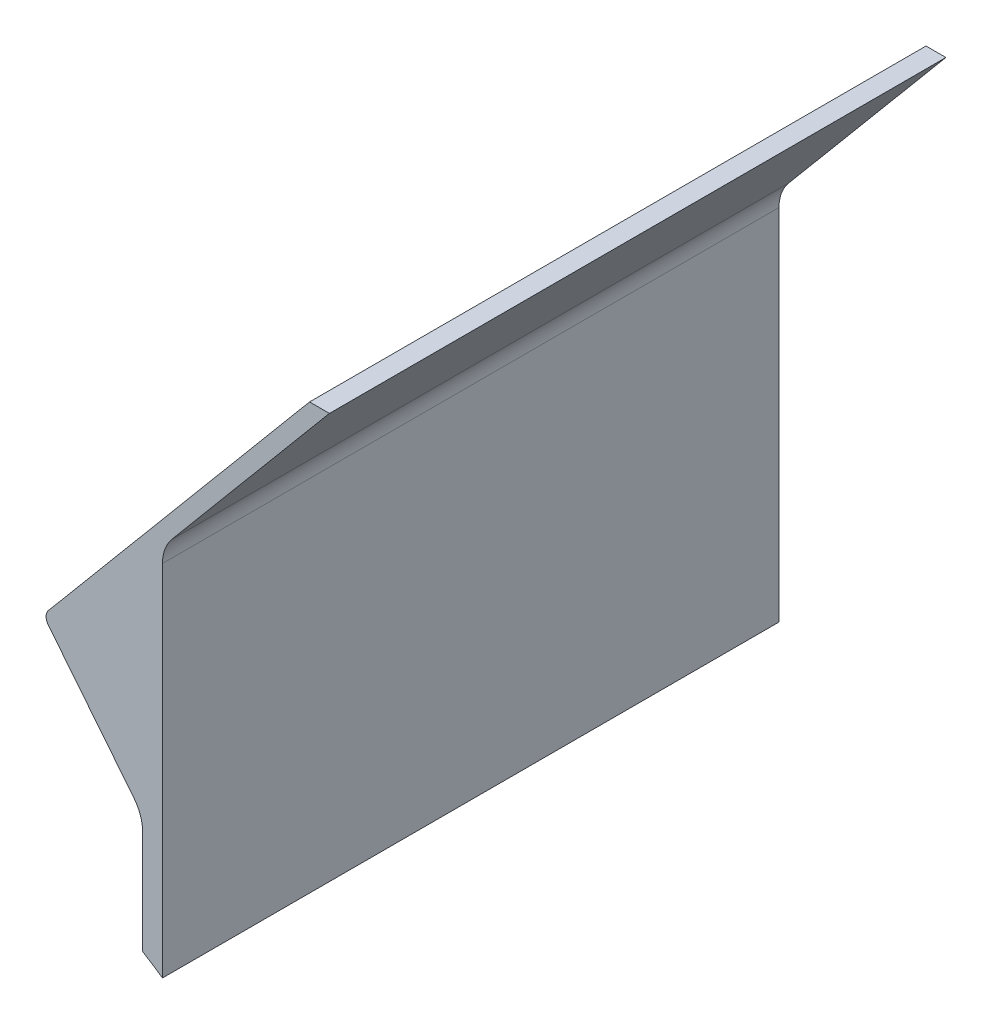
ISO-10303-21;
HEADER;
FILE_DESCRIPTION(('STEP AP214'),'2;1');
FILE_NAME('part.step','',(''),(''),'','','');
FILE_SCHEMA(('AUTOMOTIVE_DESIGN { 1 0 10303 214 1 1 1 1 }'));
ENDSEC;
DATA;
#1=APPLICATION_CONTEXT('core data for automotive mechanical design processes');
#2=APPLICATION_PROTOCOL_DEFINITION('international standard','automotive_design',2000,#1);
#3=PRODUCT_CONTEXT('',#1,'mechanical');
#4=PRODUCT('Part','Part','',(#3));
#5=PRODUCT_RELATED_PRODUCT_CATEGORY('part','',(#4));
#6=PRODUCT_DEFINITION_FORMATION('','',#4);
#7=PRODUCT_DEFINITION_CONTEXT('part definition',#1,'design');
#8=PRODUCT_DEFINITION('design','',#6,#7);
#9=PRODUCT_DEFINITION_SHAPE('','',#8);
#10=(LENGTH_UNIT() NAMED_UNIT(*) SI_UNIT(.MILLI.,.METRE.));
#11=(NAMED_UNIT(*) PLANE_ANGLE_UNIT() SI_UNIT($,.RADIAN.));
#12=(NAMED_UNIT(*) SI_UNIT($,.STERADIAN.) SOLID_ANGLE_UNIT());
#13=UNCERTAINTY_MEASURE_WITH_UNIT(LENGTH_MEASURE(1.E-05),#10,'distance_accuracy_value','');
#14=(GEOMETRIC_REPRESENTATION_CONTEXT(3) GLOBAL_UNCERTAINTY_ASSIGNED_CONTEXT((#13)) GLOBAL_UNIT_ASSIGNED_CONTEXT((#10,
#11,#12)) REPRESENTATION_CONTEXT('',''));
#15=CARTESIAN_POINT('',(0.,0.,0.));
#16=DIRECTION('',(0.,0.,1.));
#17=DIRECTION('',(1.,0.,0.));
#18=AXIS2_PLACEMENT_3D('',#15,#16,#17);
#19=CARTESIAN_POINT('',(-90.,-132.28756555323,155.));
#20=DIRECTION('',(0.,0.,-1.));
#21=DIRECTION('',(-1.,0.,0.));
#22=AXIS2_PLACEMENT_3D('',#19,#20,#21);
#23=CYLINDRICAL_SURFACE('',#22,160.);
#24=CARTESIAN_POINT('',(-90.,-132.28756555323,0.));
#25=DIRECTION('',(0.,0.,-1.));
#26=DIRECTION('',(1.,0.,0.));
#27=AXIS2_PLACEMENT_3D('',#24,#25,#26);
#28=CIRCLE('',#27,160.);
#29=CARTESIAN_POINT('',(-5.,3.26685156403007,0.));
#30=VERTEX_POINT('',#29);
#31=CARTESIAN_POINT('',(0.,0.,0.));
#32=VERTEX_POINT('',#31);
#33=EDGE_CURVE('E135',#30,#32,#28,.T.);
#34=ORIENTED_EDGE('',*,*,#33,.T.);
#35=DIRECTION('',(0.,0.,-1.));
#36=VECTOR('',#35,1.);
#37=CARTESIAN_POINT('',(0.,0.,155.));
#38=LINE('',#37,#36);
#39=CARTESIAN_POINT('',(0.,0.,155.));
#40=VERTEX_POINT('',#39);
#41=EDGE_CURVE('E116',#40,#32,#38,.T.);
#42=ORIENTED_EDGE('',*,*,#41,.F.);
#43=CARTESIAN_POINT('',(-90.,-132.28756555323,155.));
#44=DIRECTION('',(0.,0.,-1.));
#45=DIRECTION('',(1.,0.,0.));
#46=AXIS2_PLACEMENT_3D('',#43,#44,#45);
#47=CIRCLE('',#46,160.);
#48=CARTESIAN_POINT('',(-5.,3.26685156403007,155.));
#49=VERTEX_POINT('',#48);
#50=EDGE_CURVE('E123',#49,#40,#47,.T.);
#51=ORIENTED_EDGE('',*,*,#50,.F.);
#52=DIRECTION('',(0.,0.,-1.));
#53=VECTOR('',#52,1.);
#54=CARTESIAN_POINT('',(-5.,3.26685156403007,155.));
#55=LINE('',#54,#53);
#56=EDGE_CURVE('E183',#49,#30,#55,.T.);
#57=ORIENTED_EDGE('',*,*,#56,.T.);
#58=EDGE_LOOP('',(#34,#42,#51,#57));
#59=FACE_BOUND('',#58,.T.);
#60=ADVANCED_FACE('F34',(#59),#23,.F.);
#61=CARTESIAN_POINT('',(0.,0.,155.));
#62=DIRECTION('',(-1.,0.,0.));
#63=DIRECTION('',(0.,0.,1.));
#64=AXIS2_PLACEMENT_3D('',#61,#62,#63);
#65=PLANE('',#64);
#66=DIRECTION('',(0.,1.,0.));
#67=VECTOR('',#66,1.);
#68=CARTESIAN_POINT('',(0.,0.,0.));
#69=LINE('',#68,#67);
#70=CARTESIAN_POINT('',(0.,90.260297657338,0.));
#71=VERTEX_POINT('',#70);
#72=EDGE_CURVE('E193',#32,#71,#69,.T.);
#73=ORIENTED_EDGE('',*,*,#72,.T.);
#74=DIRECTION('',(0.,0.,-1.));
#75=VECTOR('',#74,1.);
#76=CARTESIAN_POINT('',(0.,90.260297657338,155.));
#77=LINE('',#76,#75);
#78=CARTESIAN_POINT('',(0.,90.260297657338,155.));
#79=VERTEX_POINT('',#78);
#80=EDGE_CURVE('E119',#71,#79,#77,.F.);
#81=ORIENTED_EDGE('',*,*,#80,.T.);
#82=DIRECTION('',(0.,1.,0.));
#83=VECTOR('',#82,1.);
#84=CARTESIAN_POINT('',(0.,0.,155.));
#85=LINE('',#84,#83);
#86=EDGE_CURVE('E111',#40,#79,#85,.T.);
#87=ORIENTED_EDGE('',*,*,#86,.F.);
#88=ORIENTED_EDGE('',*,*,#41,.T.);
#89=EDGE_LOOP('',(#73,#81,#87,#88));
#90=FACE_BOUND('',#89,.T.);
#91=ADVANCED_FACE('F114',(#90),#65,.F.);
#92=CARTESIAN_POINT('',(0.,93.9,155.));
#93=DIRECTION('',(-0.766044443118977,0.64278760968654,0.));
#94=DIRECTION('',(-0.64278760968654,-0.766044443118977,0.));
#95=AXIS2_PLACEMENT_3D('',#92,#93,#94);
#96=PLANE('',#95);
#97=DIRECTION('',(0.64278760968654,0.766044443118977,0.));
#98=VECTOR('',#97,1.);
#99=CARTESIAN_POINT('',(0.,93.9,155.));
#100=LINE('',#99,#98);
#101=CARTESIAN_POINT('',(2.33955556881023,96.6881737542034,155.));
#102=VERTEX_POINT('',#101);
#103=CARTESIAN_POINT('',(41.9740309125311,143.922702135669,155.));
#104=VERTEX_POINT('',#103);
#105=EDGE_CURVE('E122',#102,#104,#100,.T.);
#106=ORIENTED_EDGE('',*,*,#105,.F.);
#107=DIRECTION('',(0.,0.,-1.));
#108=VECTOR('',#107,1.);
#109=CARTESIAN_POINT('',(2.33955556881023,96.6881737542034,0.));
#110=LINE('',#109,#108);
#111=CARTESIAN_POINT('',(2.33955556881023,96.6881737542034,0.));
#112=VERTEX_POINT('',#111);
#113=EDGE_CURVE('E149',#102,#112,#110,.T.);
#114=ORIENTED_EDGE('',*,*,#113,.T.);
#115=DIRECTION('',(0.64278760968654,0.766044443118977,0.));
#116=VECTOR('',#115,1.);
#117=CARTESIAN_POINT('',(0.,93.9,0.));
#118=LINE('',#117,#116);
#119=CARTESIAN_POINT('',(41.9740309125311,143.922702135669,0.));
#120=VERTEX_POINT('',#119);
#121=EDGE_CURVE('E192',#112,#120,#118,.T.);
#122=ORIENTED_EDGE('',*,*,#121,.T.);
#123=DIRECTION('',(0.,0.,-1.));
#124=VECTOR('',#123,1.);
#125=CARTESIAN_POINT('',(41.9740309125311,143.922702135669,155.));
#126=LINE('',#125,#124);
#127=EDGE_CURVE('E137',#104,#120,#126,.T.);
#128=ORIENTED_EDGE('',*,*,#127,.F.);
#129=EDGE_LOOP('',(#106,#114,#122,#128));
#130=FACE_BOUND('',#129,.T.);
#131=ADVANCED_FACE('F207',(#130),#96,.F.);
#132=CARTESIAN_POINT('',(41.9740309125311,143.922702135669,155.));
#133=DIRECTION('',(0.,-1.,0.));
#134=DIRECTION('',(1.,0.,0.));
#135=AXIS2_PLACEMENT_3D('',#132,#133,#134);
#136=PLANE('',#135);
#137=DIRECTION('',(-1.,0.,0.));
#138=VECTOR('',#137,1.);
#139=CARTESIAN_POINT('',(41.9740309125311,143.922702135669,0.));
#140=LINE('',#139,#138);
#141=CARTESIAN_POINT('',(36.9740309125311,143.922702135669,0.));
#142=VERTEX_POINT('',#141);
#143=EDGE_CURVE('E179',#120,#142,#140,.T.);
#144=ORIENTED_EDGE('',*,*,#143,.T.);
#145=DIRECTION('',(0.,0.,-1.));
#146=VECTOR('',#145,1.);
#147=CARTESIAN_POINT('',(36.9740309125311,143.922702135669,155.));
#148=LINE('',#147,#146);
#149=CARTESIAN_POINT('',(36.9740309125311,143.922702135669,155.));
#150=VERTEX_POINT('',#149);
#151=EDGE_CURVE('E143',#150,#142,#148,.T.);
#152=ORIENTED_EDGE('',*,*,#151,.F.);
#153=DIRECTION('',(-1.,0.,0.));
#154=VECTOR('',#153,1.);
#155=CARTESIAN_POINT('',(41.9740309125311,143.922702135669,155.));
#156=LINE('',#155,#154);
#157=EDGE_CURVE('E201',#104,#150,#156,.T.);
#158=ORIENTED_EDGE('',*,*,#157,.F.);
#159=ORIENTED_EDGE('',*,*,#127,.T.);
#160=EDGE_LOOP('',(#144,#152,#158,#159));
#161=FACE_BOUND('',#160,.T.);
#162=ADVANCED_FACE('F208',(#161),#136,.F.);
#163=CARTESIAN_POINT('',(36.9740309125311,143.922702135669,155.));
#164=DIRECTION('',(0.766044443118977,-0.64278760968654,0.));
#165=DIRECTION('',(0.64278760968654,0.766044443118977,0.));
#166=AXIS2_PLACEMENT_3D('',#163,#164,#165);
#167=PLANE('',#166);
#168=DIRECTION('',(-0.64278760968654,-0.766044443118977,0.));
#169=VECTOR('',#168,1.);
#170=CARTESIAN_POINT('',(36.9740309125311,143.922702135669,0.));
#171=LINE('',#170,#169);
#172=CARTESIAN_POINT('',(-28.6827852863566,65.6759555523472,0.));
#173=VERTEX_POINT('',#172);
#174=EDGE_CURVE('E176',#142,#173,#171,.T.);
#175=ORIENTED_EDGE('',*,*,#174,.T.);
#176=DIRECTION('',(0.,0.,-1.));
#177=VECTOR('',#176,1.);
#178=CARTESIAN_POINT('',(-28.6827852863566,65.6759555523472,155.));
#179=LINE('',#178,#177);
#180=CARTESIAN_POINT('',(-28.6827852863566,65.6759555523472,155.));
#181=VERTEX_POINT('',#180);
#182=EDGE_CURVE('E42',#173,#181,#179,.F.);
#183=ORIENTED_EDGE('',*,*,#182,.T.);
#184=DIRECTION('',(-0.64278760968654,-0.766044443118977,0.));
#185=VECTOR('',#184,1.);
#186=CARTESIAN_POINT('',(36.9740309125311,143.922702135669,155.));
#187=LINE('',#186,#185);
#188=EDGE_CURVE('E187',#150,#181,#187,.T.);
#189=ORIENTED_EDGE('',*,*,#188,.F.);
#190=ORIENTED_EDGE('',*,*,#151,.T.);
#191=EDGE_LOOP('',(#175,#183,#189,#190));
#192=FACE_BOUND('',#191,.T.);
#193=ADVANCED_FACE('F186',(#192),#167,.F.);
#194=CARTESIAN_POINT('',(-30.,64.1061601851448,155.));
#195=DIRECTION('',(0.7806247497998,0.625,0.));
#196=DIRECTION('',(-0.625,0.7806247497998,0.));
#197=AXIS2_PLACEMENT_3D('',#194,#195,#196);
#198=PLANE('',#197);
#199=DIRECTION('',(0.625,-0.7806247497998,0.));
#200=VECTOR('',#199,1.);
#201=CARTESIAN_POINT('',(-30.,64.1061601851448,155.));
#202=LINE('',#201,#200);
#203=CARTESIAN_POINT('',(-28.7192360530587,62.5064865281309,155.));
#204=VERTEX_POINT('',#203);
#205=CARTESIAN_POINT('',(-7.19375250200201,35.6211661899496,155.));
#206=VERTEX_POINT('',#205);
#207=EDGE_CURVE('E170',#204,#206,#202,.T.);
#208=ORIENTED_EDGE('',*,*,#207,.F.);
#209=DIRECTION('',(0.,0.,-1.));
#210=VECTOR('',#209,1.);
#211=CARTESIAN_POINT('',(-28.7192360530587,62.5064865281309,155.));
#212=LINE('',#211,#210);
#213=CARTESIAN_POINT('',(-28.7192360530587,62.5064865281309,0.));
#214=VERTEX_POINT('',#213);
#215=EDGE_CURVE('E162',#204,#214,#212,.T.);
#216=ORIENTED_EDGE('',*,*,#215,.T.);
#217=DIRECTION('',(0.625,-0.7806247497998,0.));
#218=VECTOR('',#217,1.);
#219=CARTESIAN_POINT('',(-30.,64.1061601851448,0.));
#220=LINE('',#219,#218);
#221=CARTESIAN_POINT('',(-7.19375250200201,35.6211661899496,0.));
#222=VERTEX_POINT('',#221);
#223=EDGE_CURVE('E169',#214,#222,#220,.T.);
#224=ORIENTED_EDGE('',*,*,#223,.T.);
#225=DIRECTION('',(0.,0.,-1.));
#226=VECTOR('',#225,1.);
#227=CARTESIAN_POINT('',(-7.19375250200201,35.6211661899496,155.));
#228=LINE('',#227,#226);
#229=EDGE_CURVE('E140',#222,#206,#228,.F.);
#230=ORIENTED_EDGE('',*,*,#229,.T.);
#231=EDGE_LOOP('',(#208,#216,#224,#230));
#232=FACE_BOUND('',#231,.T.);
#233=ADVANCED_FACE('F168',(#232),#198,.F.);
#234=CARTESIAN_POINT('',(-5.,32.8811701931528,155.));
#235=DIRECTION('',(1.,0.,0.));
#236=DIRECTION('',(0.,0.,-1.));
#237=AXIS2_PLACEMENT_3D('',#234,#235,#236);
#238=PLANE('',#237);
#239=DIRECTION('',(0.,-1.,0.));
#240=VECTOR('',#239,1.);
#241=CARTESIAN_POINT('',(-5.,32.8811701931528,155.));
#242=LINE('',#241,#240);
#243=CARTESIAN_POINT('',(-5.,29.3711661899496,155.));
#244=VERTEX_POINT('',#243);
#245=EDGE_CURVE('E128',#244,#49,#242,.T.);
#246=ORIENTED_EDGE('',*,*,#245,.F.);
#247=DIRECTION('',(0.,0.,-1.));
#248=VECTOR('',#247,1.);
#249=CARTESIAN_POINT('',(-5.,29.3711661899496,0.));
#250=LINE('',#249,#248);
#251=CARTESIAN_POINT('',(-5.,29.3711661899496,0.));
#252=VERTEX_POINT('',#251);
#253=EDGE_CURVE('E136',#244,#252,#250,.T.);
#254=ORIENTED_EDGE('',*,*,#253,.T.);
#255=DIRECTION('',(0.,-1.,0.));
#256=VECTOR('',#255,1.);
#257=CARTESIAN_POINT('',(-5.,32.8811701931528,0.));
#258=LINE('',#257,#256);
#259=EDGE_CURVE('E132',#252,#30,#258,.T.);
#260=ORIENTED_EDGE('',*,*,#259,.T.);
#261=ORIENTED_EDGE('',*,*,#56,.F.);
#262=EDGE_LOOP('',(#246,#254,#260,#261));
#263=FACE_BOUND('',#262,.T.);
#264=ADVANCED_FACE('F234',(#263),#238,.F.);
#265=CARTESIAN_POINT('',(-90.,-132.28756555323,155.));
#266=DIRECTION('',(0.,0.,1.));
#267=DIRECTION('',(1.,0.,0.));
#268=AXIS2_PLACEMENT_3D('',#265,#266,#267);
#269=PLANE('',#268);
#270=ORIENTED_EDGE('',*,*,#188,.T.);
#271=CARTESIAN_POINT('',(-26.7676741785592,64.0689865281309,155.));
#272=DIRECTION('',(0.,0.,1.));
#273=DIRECTION('',(1.,0.,0.));
#274=AXIS2_PLACEMENT_3D('',#271,#272,#273);
#275=CIRCLE('',#274,2.5);
#276=EDGE_CURVE('E11',#181,#204,#275,.T.);
#277=ORIENTED_EDGE('',*,*,#276,.T.);
#278=ORIENTED_EDGE('',*,*,#207,.T.);
#279=CARTESIAN_POINT('',(-15.,29.3711661899496,155.));
#280=DIRECTION('',(0.,0.,1.));
#281=DIRECTION('',(1.,0.,0.));
#282=AXIS2_PLACEMENT_3D('',#279,#280,#281);
#283=CIRCLE('',#282,10.);
#284=EDGE_CURVE('E156',#206,#244,#283,.F.);
#285=ORIENTED_EDGE('',*,*,#284,.T.);
#286=ORIENTED_EDGE('',*,*,#245,.T.);
#287=ORIENTED_EDGE('',*,*,#50,.T.);
#288=ORIENTED_EDGE('',*,*,#86,.T.);
#289=CARTESIAN_POINT('',(10.,90.260297657338,155.));
#290=DIRECTION('',(0.,0.,1.));
#291=DIRECTION('',(1.,0.,0.));
#292=AXIS2_PLACEMENT_3D('',#289,#290,#291);
#293=CIRCLE('',#292,10.);
#294=EDGE_CURVE('E160',#79,#102,#293,.F.);
#295=ORIENTED_EDGE('',*,*,#294,.T.);
#296=ORIENTED_EDGE('',*,*,#105,.T.);
#297=ORIENTED_EDGE('',*,*,#157,.T.);
#298=EDGE_LOOP('',(#270,#277,#278,#285,#286,#287,#288,#295,#296,#297));
#299=FACE_BOUND('',#298,.T.);
#300=ADVANCED_FACE('F126',(#299),#269,.T.);
#301=CARTESIAN_POINT('',(-90.,-132.28756555323,0.));
#302=DIRECTION('',(0.,0.,1.));
#303=DIRECTION('',(1.,0.,0.));
#304=AXIS2_PLACEMENT_3D('',#301,#302,#303);
#305=PLANE('',#304);
#306=ORIENTED_EDGE('',*,*,#223,.F.);
#307=CARTESIAN_POINT('',(-26.7676741785592,64.0689865281309,0.));
#308=DIRECTION('',(0.,0.,1.));
#309=DIRECTION('',(1.,0.,0.));
#310=AXIS2_PLACEMENT_3D('',#307,#308,#309);
#311=CIRCLE('',#310,2.5);
#312=EDGE_CURVE('E56',#214,#173,#311,.F.);
#313=ORIENTED_EDGE('',*,*,#312,.T.);
#314=ORIENTED_EDGE('',*,*,#174,.F.);
#315=ORIENTED_EDGE('',*,*,#143,.F.);
#316=ORIENTED_EDGE('',*,*,#121,.F.);
#317=CARTESIAN_POINT('',(10.,90.260297657338,0.));
#318=DIRECTION('',(0.,0.,1.));
#319=DIRECTION('',(1.,0.,0.));
#320=AXIS2_PLACEMENT_3D('',#317,#318,#319);
#321=CIRCLE('',#320,10.);
#322=EDGE_CURVE('E158',#112,#71,#321,.T.);
#323=ORIENTED_EDGE('',*,*,#322,.T.);
#324=ORIENTED_EDGE('',*,*,#72,.F.);
#325=ORIENTED_EDGE('',*,*,#33,.F.);
#326=ORIENTED_EDGE('',*,*,#259,.F.);
#327=CARTESIAN_POINT('',(-15.,29.3711661899496,0.));
#328=DIRECTION('',(0.,0.,1.));
#329=DIRECTION('',(1.,0.,0.));
#330=AXIS2_PLACEMENT_3D('',#327,#328,#329);
#331=CIRCLE('',#330,10.);
#332=EDGE_CURVE('E153',#252,#222,#331,.T.);
#333=ORIENTED_EDGE('',*,*,#332,.T.);
#334=EDGE_LOOP('',(#306,#313,#314,#315,#316,#323,#324,#325,#326,#333));
#335=FACE_BOUND('',#334,.T.);
#336=ADVANCED_FACE('F173',(#335),#305,.F.);
#337=CARTESIAN_POINT('',(-15.,29.3711661899496,155.));
#338=DIRECTION('',(0.,0.,1.));
#339=DIRECTION('',(1.,0.,0.));
#340=AXIS2_PLACEMENT_3D('',#337,#338,#339);
#341=CYLINDRICAL_SURFACE('',#340,10.);
#342=ORIENTED_EDGE('',*,*,#284,.F.);
#343=ORIENTED_EDGE('',*,*,#229,.F.);
#344=ORIENTED_EDGE('',*,*,#332,.F.);
#345=ORIENTED_EDGE('',*,*,#253,.F.);
#346=EDGE_LOOP('',(#342,#343,#344,#345));
#347=FACE_BOUND('',#346,.T.);
#348=ADVANCED_FACE('F224',(#347),#341,.F.);
#349=CARTESIAN_POINT('',(10.,90.260297657338,155.));
#350=DIRECTION('',(0.,0.,1.));
#351=DIRECTION('',(1.,0.,0.));
#352=AXIS2_PLACEMENT_3D('',#349,#350,#351);
#353=CYLINDRICAL_SURFACE('',#352,10.);
#354=ORIENTED_EDGE('',*,*,#294,.F.);
#355=ORIENTED_EDGE('',*,*,#80,.F.);
#356=ORIENTED_EDGE('',*,*,#322,.F.);
#357=ORIENTED_EDGE('',*,*,#113,.F.);
#358=EDGE_LOOP('',(#354,#355,#356,#357));
#359=FACE_BOUND('',#358,.T.);
#360=ADVANCED_FACE('F226',(#359),#353,.F.);
#361=CARTESIAN_POINT('',(-26.7676741785592,64.0689865281309,155.));
#362=DIRECTION('',(0.,0.,-1.));
#363=DIRECTION('',(-1.,0.,0.));
#364=AXIS2_PLACEMENT_3D('',#361,#362,#363);
#365=CYLINDRICAL_SURFACE('',#364,2.5);
#366=ORIENTED_EDGE('',*,*,#276,.F.);
#367=ORIENTED_EDGE('',*,*,#182,.F.);
#368=ORIENTED_EDGE('',*,*,#312,.F.);
#369=ORIENTED_EDGE('',*,*,#215,.F.);
#370=EDGE_LOOP('',(#366,#367,#368,#369));
#371=FACE_BOUND('',#370,.T.);
#372=ADVANCED_FACE('F36',(#371),#365,.T.);
#373=CLOSED_SHELL('',(#60,#91,#131,#162,#193,#233,#264,#300,#336,#348,#360,#372));
#374=MANIFOLD_SOLID_BREP('B2',#373);
#375=ADVANCED_BREP_SHAPE_REPRESENTATION('',(#18,#374),#14);
#376=SHAPE_DEFINITION_REPRESENTATION(#9,#375);
ENDSEC;
END-ISO-10303-21;
